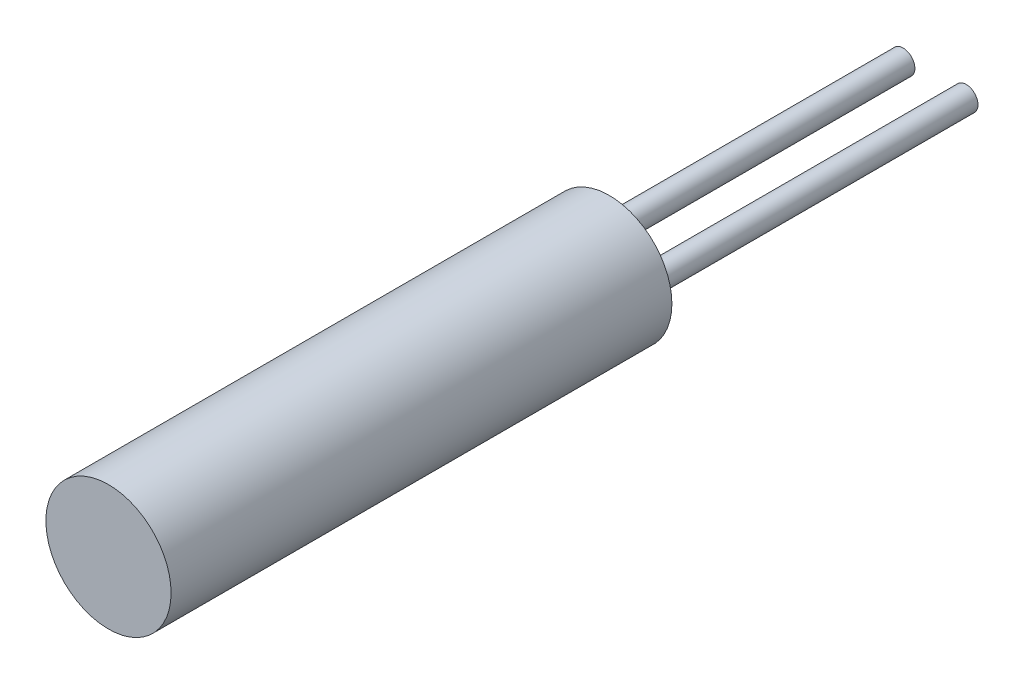
ISO-10303-21;
HEADER;
FILE_DESCRIPTION(('STEP AP214'),'2;1');
FILE_NAME('part.step','',(''),(''),'','','');
FILE_SCHEMA(('AUTOMOTIVE_DESIGN { 1 0 10303 214 1 1 1 1 }'));
ENDSEC;
DATA;
#1=APPLICATION_CONTEXT('core data for automotive mechanical design processes');
#2=APPLICATION_PROTOCOL_DEFINITION('international standard','automotive_design',2000,#1);
#3=PRODUCT_CONTEXT('',#1,'mechanical');
#4=PRODUCT('Part','Part','',(#3));
#5=PRODUCT_RELATED_PRODUCT_CATEGORY('part','',(#4));
#6=PRODUCT_DEFINITION_FORMATION('','',#4);
#7=PRODUCT_DEFINITION_CONTEXT('part definition',#1,'design');
#8=PRODUCT_DEFINITION('design','',#6,#7);
#9=PRODUCT_DEFINITION_SHAPE('','',#8);
#10=(LENGTH_UNIT() NAMED_UNIT(*) SI_UNIT(.MILLI.,.METRE.));
#11=(NAMED_UNIT(*) PLANE_ANGLE_UNIT() SI_UNIT($,.RADIAN.));
#12=(NAMED_UNIT(*) SI_UNIT($,.STERADIAN.) SOLID_ANGLE_UNIT());
#13=UNCERTAINTY_MEASURE_WITH_UNIT(LENGTH_MEASURE(1.E-05),#10,'distance_accuracy_value','');
#14=(GEOMETRIC_REPRESENTATION_CONTEXT(3) GLOBAL_UNCERTAINTY_ASSIGNED_CONTEXT((#13)) GLOBAL_UNIT_ASSIGNED_CONTEXT((#10,
#11,#12)) REPRESENTATION_CONTEXT('',''));
#15=CARTESIAN_POINT('',(0.,0.,0.));
#16=DIRECTION('',(0.,0.,1.));
#17=DIRECTION('',(1.,0.,0.));
#18=AXIS2_PLACEMENT_3D('',#15,#16,#17);
#19=CARTESIAN_POINT('',(0.,0.,0.));
#20=DIRECTION('',(0.,0.,1.));
#21=DIRECTION('',(1.,0.,0.));
#22=AXIS2_PLACEMENT_3D('',#19,#20,#21);
#23=PLANE('',#22);
#24=CARTESIAN_POINT('',(1.6,0.,0.));
#25=DIRECTION('',(0.,0.,1.));
#26=DIRECTION('',(1.,0.,0.));
#27=AXIS2_PLACEMENT_3D('',#24,#25,#26);
#28=CIRCLE('',#27,0.6);
#29=CARTESIAN_POINT('',(2.2,0.,0.));
#30=VERTEX_POINT('',#29);
#31=EDGE_CURVE('E39',#30,#30,#28,.F.);
#32=ORIENTED_EDGE('',*,*,#31,.F.);
#33=EDGE_LOOP('',(#32));
#34=FACE_BOUND('',#33,.T.);
#35=CARTESIAN_POINT('',(0.,0.,0.));
#36=DIRECTION('',(0.,0.,1.));
#37=DIRECTION('',(1.,0.,0.));
#38=AXIS2_PLACEMENT_3D('',#35,#36,#37);
#39=CIRCLE('',#38,3.175);
#40=CARTESIAN_POINT('',(3.175,0.,0.));
#41=VERTEX_POINT('',#40);
#42=EDGE_CURVE('E47',#41,#41,#39,.T.);
#43=ORIENTED_EDGE('',*,*,#42,.F.);
#44=EDGE_LOOP('',(#43));
#45=FACE_BOUND('',#44,.T.);
#46=CARTESIAN_POINT('',(-1.6,0.,0.));
#47=DIRECTION('',(0.,0.,1.));
#48=DIRECTION('',(1.,0.,0.));
#49=AXIS2_PLACEMENT_3D('',#46,#47,#48);
#50=CIRCLE('',#49,0.6);
#51=CARTESIAN_POINT('',(-1.,0.,0.));
#52=VERTEX_POINT('',#51);
#53=EDGE_CURVE('E10',#52,#52,#50,.F.);
#54=ORIENTED_EDGE('',*,*,#53,.F.);
#55=EDGE_LOOP('',(#54));
#56=FACE_BOUND('',#55,.T.);
#57=ADVANCED_FACE('F32',(#34,#45,#56),#23,.F.);
#58=CARTESIAN_POINT('',(0.,0.,25.4));
#59=DIRECTION('',(0.,0.,-1.));
#60=DIRECTION('',(-1.,0.,0.));
#61=AXIS2_PLACEMENT_3D('',#58,#59,#60);
#62=CYLINDRICAL_SURFACE('',#61,3.175);
#63=CARTESIAN_POINT('',(0.,0.,25.4));
#64=DIRECTION('',(0.,0.,1.));
#65=DIRECTION('',(1.,0.,0.));
#66=AXIS2_PLACEMENT_3D('',#63,#64,#65);
#67=CIRCLE('',#66,3.175);
#68=CARTESIAN_POINT('',(3.175,0.,25.4));
#69=VERTEX_POINT('',#68);
#70=EDGE_CURVE('E43',#69,#69,#67,.T.);
#71=ORIENTED_EDGE('',*,*,#70,.F.);
#72=EDGE_LOOP('',(#71));
#73=FACE_BOUND('',#72,.T.);
#74=ORIENTED_EDGE('',*,*,#42,.T.);
#75=EDGE_LOOP('',(#74));
#76=FACE_BOUND('',#75,.T.);
#77=ADVANCED_FACE('F34',(#73,#76),#62,.T.);
#78=CARTESIAN_POINT('',(0.,0.,25.4));
#79=DIRECTION('',(0.,0.,1.));
#80=DIRECTION('',(1.,0.,0.));
#81=AXIS2_PLACEMENT_3D('',#78,#79,#80);
#82=PLANE('',#81);
#83=ORIENTED_EDGE('',*,*,#70,.T.);
#84=EDGE_LOOP('',(#83));
#85=FACE_BOUND('',#84,.T.);
#86=ADVANCED_FACE('F78',(#85),#82,.T.);
#87=CARTESIAN_POINT('',(1.6,0.,-16.5));
#88=DIRECTION('',(0.,0.,1.));
#89=DIRECTION('',(1.,0.,0.));
#90=AXIS2_PLACEMENT_3D('',#87,#88,#89);
#91=CYLINDRICAL_SURFACE('',#90,0.6);
#92=CARTESIAN_POINT('',(1.6,0.,-16.5));
#93=DIRECTION('',(0.,0.,-1.));
#94=DIRECTION('',(-1.,0.,0.));
#95=AXIS2_PLACEMENT_3D('',#92,#93,#94);
#96=CIRCLE('',#95,0.6);
#97=CARTESIAN_POINT('',(1.,0.,-16.5));
#98=VERTEX_POINT('',#97);
#99=EDGE_CURVE('E51',#98,#98,#96,.T.);
#100=ORIENTED_EDGE('',*,*,#99,.F.);
#101=EDGE_LOOP('',(#100));
#102=FACE_BOUND('',#101,.T.);
#103=ORIENTED_EDGE('',*,*,#31,.T.);
#104=EDGE_LOOP('',(#103));
#105=FACE_BOUND('',#104,.T.);
#106=ADVANCED_FACE('F70',(#102,#105),#91,.T.);
#107=CARTESIAN_POINT('',(1.6,0.,-16.5));
#108=DIRECTION('',(0.,0.,-1.));
#109=DIRECTION('',(-1.,0.,0.));
#110=AXIS2_PLACEMENT_3D('',#107,#108,#109);
#111=PLANE('',#110);
#112=ORIENTED_EDGE('',*,*,#99,.T.);
#113=EDGE_LOOP('',(#112));
#114=FACE_BOUND('',#113,.T.);
#115=ADVANCED_FACE('F63',(#114),#111,.T.);
#116=CARTESIAN_POINT('',(-1.6,0.,-16.5));
#117=DIRECTION('',(0.,0.,1.));
#118=DIRECTION('',(1.,0.,0.));
#119=AXIS2_PLACEMENT_3D('',#116,#117,#118);
#120=CYLINDRICAL_SURFACE('',#119,0.6);
#121=CARTESIAN_POINT('',(-1.6,0.,-16.5));
#122=DIRECTION('',(0.,0.,-1.));
#123=DIRECTION('',(-1.,0.,0.));
#124=AXIS2_PLACEMENT_3D('',#121,#122,#123);
#125=CIRCLE('',#124,0.6);
#126=CARTESIAN_POINT('',(-2.2,0.,-16.5));
#127=VERTEX_POINT('',#126);
#128=EDGE_CURVE('E55',#127,#127,#125,.T.);
#129=ORIENTED_EDGE('',*,*,#128,.F.);
#130=EDGE_LOOP('',(#129));
#131=FACE_BOUND('',#130,.T.);
#132=ORIENTED_EDGE('',*,*,#53,.T.);
#133=EDGE_LOOP('',(#132));
#134=FACE_BOUND('',#133,.T.);
#135=ADVANCED_FACE('F61',(#131,#134),#120,.T.);
#136=CARTESIAN_POINT('',(-1.6,0.,-16.5));
#137=DIRECTION('',(0.,0.,-1.));
#138=DIRECTION('',(-1.,0.,0.));
#139=AXIS2_PLACEMENT_3D('',#136,#137,#138);
#140=PLANE('',#139);
#141=ORIENTED_EDGE('',*,*,#128,.T.);
#142=EDGE_LOOP('',(#141));
#143=FACE_BOUND('',#142,.T.);
#144=ADVANCED_FACE('F59',(#143),#140,.T.);
#145=CLOSED_SHELL('',(#57,#77,#86,#106,#115,#135,#144));
#146=MANIFOLD_SOLID_BREP('B2',#145);
#147=ADVANCED_BREP_SHAPE_REPRESENTATION('',(#18,#146),#14);
#148=SHAPE_DEFINITION_REPRESENTATION(#9,#147);
ENDSEC;
END-ISO-10303-21;
